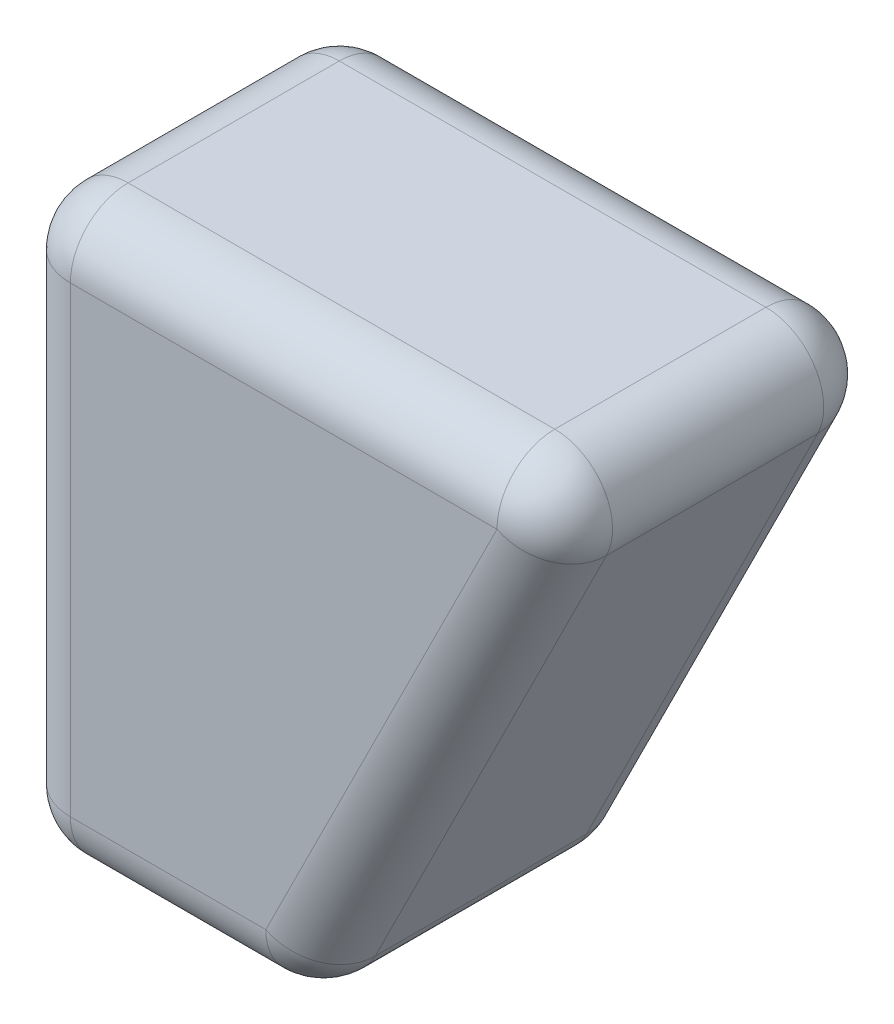
ISO-10303-21;
HEADER;
FILE_DESCRIPTION(('STEP AP214'),'2;1');
FILE_NAME('part.step','',(''),(''),'','','');
FILE_SCHEMA(('AUTOMOTIVE_DESIGN { 1 0 10303 214 1 1 1 1 }'));
ENDSEC;
DATA;
#1=APPLICATION_CONTEXT('core data for automotive mechanical design processes');
#2=APPLICATION_PROTOCOL_DEFINITION('international standard','automotive_design',2000,#1);
#3=PRODUCT_CONTEXT('',#1,'mechanical');
#4=PRODUCT('Part','Part','',(#3));
#5=PRODUCT_RELATED_PRODUCT_CATEGORY('part','',(#4));
#6=PRODUCT_DEFINITION_FORMATION('','',#4);
#7=PRODUCT_DEFINITION_CONTEXT('part definition',#1,'design');
#8=PRODUCT_DEFINITION('design','',#6,#7);
#9=PRODUCT_DEFINITION_SHAPE('','',#8);
#10=(LENGTH_UNIT() NAMED_UNIT(*) SI_UNIT(.MILLI.,.METRE.));
#11=(NAMED_UNIT(*) PLANE_ANGLE_UNIT() SI_UNIT($,.RADIAN.));
#12=(NAMED_UNIT(*) SI_UNIT($,.STERADIAN.) SOLID_ANGLE_UNIT());
#13=UNCERTAINTY_MEASURE_WITH_UNIT(LENGTH_MEASURE(1.E-05),#10,'distance_accuracy_value','');
#14=(GEOMETRIC_REPRESENTATION_CONTEXT(3) GLOBAL_UNCERTAINTY_ASSIGNED_CONTEXT((#13)) GLOBAL_UNIT_ASSIGNED_CONTEXT((#10,
#11,#12)) REPRESENTATION_CONTEXT('',''));
#15=CARTESIAN_POINT('',(0.,0.,0.));
#16=DIRECTION('',(0.,0.,1.));
#17=DIRECTION('',(1.,0.,0.));
#18=AXIS2_PLACEMENT_3D('',#15,#16,#17);
#19=CARTESIAN_POINT('',(99.9999999998445,130.770794392528,-56.5363275961389));
#20=DIRECTION('',(0.,0.,-1.));
#21=DIRECTION('',(1.,0.,0.));
#22=AXIS2_PLACEMENT_3D('',#19,#20,#21);
#23=PLANE('',#22);
#24=DIRECTION('',(-1.,0.,0.));
#25=VECTOR('',#24,1.);
#26=CARTESIAN_POINT('',(99.9999999998445,20.7707943925285,-56.5363275961389));
#27=LINE('',#26,#25);
#28=CARTESIAN_POINT('',(10.0000000000007,20.7707943925285,-56.5363275961389));
#29=VERTEX_POINT('',#28);
#30=CARTESIAN_POINT('',(83.8196601125024,20.7707943925285,-56.5363275961389));
#31=VERTEX_POINT('',#30);
#32=EDGE_CURVE('E169',#29,#31,#27,.F.);
#33=ORIENTED_EDGE('',*,*,#32,.T.);
#34=DIRECTION('',(0.447213595499924,0.894427190999933,0.));
#35=VECTOR('',#34,1.);
#36=CARTESIAN_POINT('',(131.055728089968,115.242930347468,-56.5363275961389));
#37=LINE('',#36,#35);
#38=CARTESIAN_POINT('',(43.8196601125017,-59.2292056074806,-56.5363275961389));
#39=VERTEX_POINT('',#38);
#40=EDGE_CURVE('E171',#31,#39,#37,.F.);
#41=ORIENTED_EDGE('',*,*,#40,.T.);
#42=DIRECTION('',(1.,0.,0.));
#43=VECTOR('',#42,1.);
#44=CARTESIAN_POINT('',(99.9999999998445,-59.2292056074805,-56.5363275961389));
#45=LINE('',#44,#43);
#46=CARTESIAN_POINT('',(10.0000000000009,-59.2292056074806,-56.5363275961389));
#47=VERTEX_POINT('',#46);
#48=EDGE_CURVE('E165',#39,#47,#45,.F.);
#49=ORIENTED_EDGE('',*,*,#48,.T.);
#50=DIRECTION('',(0.,-1.,0.));
#51=VECTOR('',#50,1.);
#52=CARTESIAN_POINT('',(10.0000000000005,130.770794392528,-56.5363275961389));
#53=LINE('',#52,#51);
#54=EDGE_CURVE('E167',#47,#29,#53,.F.);
#55=ORIENTED_EDGE('',*,*,#54,.T.);
#56=EDGE_LOOP('',(#33,#41,#49,#55));
#57=FACE_BOUND('',#56,.T.);
#58=ADVANCED_FACE('F33',(#57),#23,.T.);
#59=CARTESIAN_POINT('',(0.,0.,0.));
#60=DIRECTION('',(0.,0.,1.));
#61=DIRECTION('',(1.,0.,0.));
#62=AXIS2_PLACEMENT_3D('',#59,#60,#61);
#63=PLANE('',#62);
#64=DIRECTION('',(1.,0.,0.));
#65=VECTOR('',#64,1.);
#66=CARTESIAN_POINT('',(0.,-59.2292056074806,0.));
#67=LINE('',#66,#65);
#68=CARTESIAN_POINT('',(10.0000000000009,-59.2292056074806,0.));
#69=VERTEX_POINT('',#68);
#70=CARTESIAN_POINT('',(43.8196601125017,-59.2292056074806,0.));
#71=VERTEX_POINT('',#70);
#72=EDGE_CURVE('E183',#69,#71,#67,.T.);
#73=ORIENTED_EDGE('',*,*,#72,.T.);
#74=DIRECTION('',(0.447213595499924,0.894427190999933,0.));
#75=VECTOR('',#74,1.);
#76=CARTESIAN_POINT('',(58.7474103329936,-29.373705166494,0.));
#77=LINE('',#76,#75);
#78=CARTESIAN_POINT('',(83.8196601125024,20.7707943925285,0.));
#79=VERTEX_POINT('',#78);
#80=EDGE_CURVE('E139',#71,#79,#77,.T.);
#81=ORIENTED_EDGE('',*,*,#80,.T.);
#82=DIRECTION('',(-1.,0.,0.));
#83=VECTOR('',#82,1.);
#84=CARTESIAN_POINT('',(0.,20.7707943925285,0.));
#85=LINE('',#84,#83);
#86=CARTESIAN_POINT('',(10.0000000000007,20.7707943925285,0.));
#87=VERTEX_POINT('',#86);
#88=EDGE_CURVE('E187',#79,#87,#85,.T.);
#89=ORIENTED_EDGE('',*,*,#88,.T.);
#90=DIRECTION('',(0.,-1.,0.));
#91=VECTOR('',#90,1.);
#92=CARTESIAN_POINT('',(10.0000000000007,0.,0.));
#93=LINE('',#92,#91);
#94=EDGE_CURVE('E185',#87,#69,#93,.T.);
#95=ORIENTED_EDGE('',*,*,#94,.T.);
#96=EDGE_LOOP('',(#73,#81,#89,#95));
#97=FACE_BOUND('',#96,.T.);
#98=ADVANCED_FACE('F297',(#97),#63,.T.);
#99=CARTESIAN_POINT('',(100.000000000001,30.7707943925285,-197.957683833455));
#100=DIRECTION('',(0.,1.,0.));
#101=DIRECTION('',(0.,0.,1.));
#102=AXIS2_PLACEMENT_3D('',#99,#100,#101);
#103=PLANE('',#102);
#104=DIRECTION('',(-1.,0.,0.));
#105=VECTOR('',#104,1.);
#106=CARTESIAN_POINT('',(100.000000000001,30.7707943925285,-10.));
#107=LINE('',#106,#105);
#108=CARTESIAN_POINT('',(10.0000000000007,30.7707943925285,-10.));
#109=VERTEX_POINT('',#108);
#110=CARTESIAN_POINT('',(83.8196601125024,30.7707943925285,-10.));
#111=VERTEX_POINT('',#110);
#112=EDGE_CURVE('E176',#109,#111,#107,.F.);
#113=ORIENTED_EDGE('',*,*,#112,.T.);
#114=DIRECTION('',(0.,0.,1.));
#115=VECTOR('',#114,1.);
#116=CARTESIAN_POINT('',(83.8196601125024,30.7707943925285,-197.957683833455));
#117=LINE('',#116,#115);
#118=CARTESIAN_POINT('',(83.8196601125024,30.7707943925285,-46.5363275961389));
#119=VERTEX_POINT('',#118);
#120=EDGE_CURVE('E180',#111,#119,#117,.F.);
#121=ORIENTED_EDGE('',*,*,#120,.T.);
#122=DIRECTION('',(-1.,0.,0.));
#123=VECTOR('',#122,1.);
#124=CARTESIAN_POINT('',(100.000000000001,30.7707943925285,-46.5363275961389));
#125=LINE('',#124,#123);
#126=CARTESIAN_POINT('',(10.0000000000007,30.7707943925285,-46.5363275961389));
#127=VERTEX_POINT('',#126);
#128=EDGE_CURVE('E178',#119,#127,#125,.T.);
#129=ORIENTED_EDGE('',*,*,#128,.T.);
#130=DIRECTION('',(0.,0.,1.));
#131=VECTOR('',#130,1.);
#132=CARTESIAN_POINT('',(10.0000000000007,30.7707943925285,-197.957683833455));
#133=LINE('',#132,#131);
#134=EDGE_CURVE('E174',#127,#109,#133,.T.);
#135=ORIENTED_EDGE('',*,*,#134,.T.);
#136=EDGE_LOOP('',(#113,#121,#129,#135));
#137=FACE_BOUND('',#136,.T.);
#138=ADVANCED_FACE('F266',(#137),#103,.T.);
#139=CARTESIAN_POINT('',(6.93889390390723E-13,30.7707943925285,-197.957683833455));
#140=DIRECTION('',(-1.,0.,0.));
#141=DIRECTION('',(0.,-1.,0.));
#142=AXIS2_PLACEMENT_3D('',#139,#140,#141);
#143=PLANE('',#142);
#144=DIRECTION('',(0.,0.,1.));
#145=VECTOR('',#144,1.);
#146=CARTESIAN_POINT('',(8.56259507742154E-13,-59.2292056074806,-197.957683833455));
#147=LINE('',#146,#145);
#148=CARTESIAN_POINT('',(8.56259507742154E-13,-59.2292056074806,-46.5363275961389));
#149=VERTEX_POINT('',#148);
#150=CARTESIAN_POINT('',(8.56259507742154E-13,-59.2292056074806,-10.));
#151=VERTEX_POINT('',#150);
#152=EDGE_CURVE('E190',#149,#151,#147,.T.);
#153=ORIENTED_EDGE('',*,*,#152,.T.);
#154=DIRECTION('',(0.,-1.,0.));
#155=VECTOR('',#154,1.);
#156=CARTESIAN_POINT('',(6.93889390390723E-13,30.7707943925285,-10.));
#157=LINE('',#156,#155);
#158=CARTESIAN_POINT('',(7.1193051454088E-13,20.7707943925285,-10.));
#159=VERTEX_POINT('',#158);
#160=EDGE_CURVE('E196',#151,#159,#157,.F.);
#161=ORIENTED_EDGE('',*,*,#160,.T.);
#162=DIRECTION('',(0.,0.,1.));
#163=VECTOR('',#162,1.);
#164=CARTESIAN_POINT('',(7.1193051454088E-13,20.7707943925285,-197.957683833455));
#165=LINE('',#164,#163);
#166=CARTESIAN_POINT('',(7.1193051454088E-13,20.7707943925285,-46.5363275961389));
#167=VERTEX_POINT('',#166);
#168=EDGE_CURVE('E194',#159,#167,#165,.F.);
#169=ORIENTED_EDGE('',*,*,#168,.T.);
#170=DIRECTION('',(0.,-1.,0.));
#171=VECTOR('',#170,1.);
#172=CARTESIAN_POINT('',(6.93889390390723E-13,30.7707943925285,-46.5363275961389));
#173=LINE('',#172,#171);
#174=EDGE_CURVE('E192',#167,#149,#173,.T.);
#175=ORIENTED_EDGE('',*,*,#174,.T.);
#176=EDGE_LOOP('',(#153,#161,#169,#175));
#177=FACE_BOUND('',#176,.T.);
#178=ADVANCED_FACE('F275',(#177),#143,.T.);
#179=CARTESIAN_POINT('',(8.74300631892311E-13,-69.2292056074806,-197.957683833455));
#180=DIRECTION('',(0.,-1.,0.));
#181=DIRECTION('',(0.,0.,-1.));
#182=AXIS2_PLACEMENT_3D('',#179,#180,#181);
#183=PLANE('',#182);
#184=DIRECTION('',(0.,0.,1.));
#185=VECTOR('',#184,1.);
#186=CARTESIAN_POINT('',(43.8196601125017,-69.2292056074806,-197.957683833455));
#187=LINE('',#186,#185);
#188=CARTESIAN_POINT('',(43.8196601125017,-69.2292056074806,-46.5363275961389));
#189=VERTEX_POINT('',#188);
#190=CARTESIAN_POINT('',(43.8196601125017,-69.2292056074806,-10.));
#191=VERTEX_POINT('',#190);
#192=EDGE_CURVE('E199',#189,#191,#187,.T.);
#193=ORIENTED_EDGE('',*,*,#192,.T.);
#194=DIRECTION('',(1.,0.,0.));
#195=VECTOR('',#194,1.);
#196=CARTESIAN_POINT('',(8.74300631892311E-13,-69.2292056074806,-10.));
#197=LINE('',#196,#195);
#198=CARTESIAN_POINT('',(10.0000000000009,-69.2292056074806,-10.));
#199=VERTEX_POINT('',#198);
#200=EDGE_CURVE('E11',#191,#199,#197,.F.);
#201=ORIENTED_EDGE('',*,*,#200,.T.);
#202=DIRECTION('',(0.,0.,1.));
#203=VECTOR('',#202,1.);
#204=CARTESIAN_POINT('',(10.0000000000009,-69.2292056074806,-197.957683833455));
#205=LINE('',#204,#203);
#206=CARTESIAN_POINT('',(10.0000000000009,-69.2292056074806,-46.5363275961389));
#207=VERTEX_POINT('',#206);
#208=EDGE_CURVE('E42',#199,#207,#205,.F.);
#209=ORIENTED_EDGE('',*,*,#208,.T.);
#210=DIRECTION('',(1.,0.,0.));
#211=VECTOR('',#210,1.);
#212=CARTESIAN_POINT('',(8.74481608642121E-13,-69.2292056074806,-46.5363275961389));
#213=LINE('',#212,#211);
#214=EDGE_CURVE('E201',#207,#189,#213,.T.);
#215=ORIENTED_EDGE('',*,*,#214,.T.);
#216=EDGE_LOOP('',(#193,#201,#209,#215));
#217=FACE_BOUND('',#216,.T.);
#218=ADVANCED_FACE('F310',(#217),#183,.T.);
#219=CARTESIAN_POINT('',(50.0000000000009,-69.2292056074806,-197.957683833455));
#220=DIRECTION('',(0.894427190999933,-0.447213595499924,0.));
#221=DIRECTION('',(0.447213595499924,0.894427190999933,0.));
#222=AXIS2_PLACEMENT_3D('',#219,#220,#221);
#223=PLANE('',#222);
#224=DIRECTION('',(0.,0.,1.));
#225=VECTOR('',#224,1.);
#226=CARTESIAN_POINT('',(52.763932022501,-63.7013415624798,-197.957683833455));
#227=LINE('',#226,#225);
#228=CARTESIAN_POINT('',(52.763932022501,-63.7013415624798,-10.));
#229=VERTEX_POINT('',#228);
#230=CARTESIAN_POINT('',(52.763932022501,-63.7013415624798,-46.5363275961389));
#231=VERTEX_POINT('',#230);
#232=EDGE_CURVE('E125',#229,#231,#227,.F.);
#233=ORIENTED_EDGE('',*,*,#232,.T.);
#234=DIRECTION('',(0.447213595499924,0.894427190999933,0.));
#235=VECTOR('',#234,1.);
#236=CARTESIAN_POINT('',(50.0000000000009,-69.2292056074805,-46.5363275961389));
#237=LINE('',#236,#235);
#238=CARTESIAN_POINT('',(92.7639320225017,16.2986584375292,-46.5363275961389));
#239=VERTEX_POINT('',#238);
#240=EDGE_CURVE('E163',#231,#239,#237,.T.);
#241=ORIENTED_EDGE('',*,*,#240,.T.);
#242=DIRECTION('',(0.,0.,1.));
#243=VECTOR('',#242,1.);
#244=CARTESIAN_POINT('',(92.7639320225017,16.2986584375292,-197.957683833455));
#245=LINE('',#244,#243);
#246=CARTESIAN_POINT('',(92.7639320225017,16.2986584375292,-10.));
#247=VERTEX_POINT('',#246);
#248=EDGE_CURVE('E128',#239,#247,#245,.T.);
#249=ORIENTED_EDGE('',*,*,#248,.T.);
#250=DIRECTION('',(0.447213595499924,0.894427190999933,0.));
#251=VECTOR('',#250,1.);
#252=CARTESIAN_POINT('',(50.0000000000009,-69.2292056074806,-10.));
#253=LINE('',#252,#251);
#254=EDGE_CURVE('E120',#247,#229,#253,.F.);
#255=ORIENTED_EDGE('',*,*,#254,.T.);
#256=EDGE_LOOP('',(#233,#241,#249,#255));
#257=FACE_BOUND('',#256,.T.);
#258=ADVANCED_FACE('F122',(#257),#223,.T.);
#259=CARTESIAN_POINT('',(10.0000000000007,0.,-10.));
#260=DIRECTION('',(0.,-1.,0.));
#261=DIRECTION('',(1.,0.,0.));
#262=AXIS2_PLACEMENT_3D('',#259,#260,#261);
#263=CYLINDRICAL_SURFACE('',#262,10.);
#264=CARTESIAN_POINT('',(10.0000000000009,-59.2292056074806,-10.));
#265=DIRECTION('',(0.,-1.,0.));
#266=DIRECTION('',(1.,0.,0.));
#267=AXIS2_PLACEMENT_3D('',#264,#265,#266);
#268=CIRCLE('',#267,10.);
#269=EDGE_CURVE('E37',#69,#151,#268,.T.);
#270=ORIENTED_EDGE('',*,*,#269,.F.);
#271=ORIENTED_EDGE('',*,*,#94,.F.);
#272=CARTESIAN_POINT('',(10.0000000000007,20.7707943925285,-10.));
#273=DIRECTION('',(0.,1.,0.));
#274=DIRECTION('',(-1.,0.,0.));
#275=AXIS2_PLACEMENT_3D('',#272,#273,#274);
#276=CIRCLE('',#275,10.);
#277=EDGE_CURVE('E160',#159,#87,#276,.T.);
#278=ORIENTED_EDGE('',*,*,#277,.F.);
#279=ORIENTED_EDGE('',*,*,#160,.F.);
#280=EDGE_LOOP('',(#270,#271,#278,#279));
#281=FACE_BOUND('',#280,.T.);
#282=ADVANCED_FACE('F35',(#281),#263,.T.);
#283=CARTESIAN_POINT('',(10.0000000000009,-59.2292056074806,-10.));
#284=DIRECTION('',(0.,0.,1.));
#285=DIRECTION('',(1.,0.,0.));
#286=AXIS2_PLACEMENT_3D('',#283,#284,#285);
#287=SPHERICAL_SURFACE('',#286,10.);
#288=CARTESIAN_POINT('',(10.0000000000009,-59.2292056074806,-10.));
#289=DIRECTION('',(-1.,0.,0.));
#290=DIRECTION('',(0.,0.,1.));
#291=AXIS2_PLACEMENT_3D('',#288,#289,#290);
#292=CIRCLE('',#291,10.);
#293=EDGE_CURVE('E246',#69,#199,#292,.F.);
#294=ORIENTED_EDGE('',*,*,#293,.F.);
#295=ORIENTED_EDGE('',*,*,#269,.T.);
#296=CARTESIAN_POINT('',(10.0000000000009,-59.2292056074806,-10.));
#297=DIRECTION('',(0.,0.,1.));
#298=DIRECTION('',(1.,0.,0.));
#299=AXIS2_PLACEMENT_3D('',#296,#297,#298);
#300=CIRCLE('',#299,10.);
#301=EDGE_CURVE('E249',#199,#151,#300,.F.);
#302=ORIENTED_EDGE('',*,*,#301,.F.);
#303=EDGE_LOOP('',(#294,#295,#302));
#304=FACE_BOUND('',#303,.T.);
#305=ADVANCED_FACE('F291',(#304),#287,.T.);
#306=CARTESIAN_POINT('',(10.0000000000007,20.7707943925285,-10.));
#307=DIRECTION('',(0.,0.,1.));
#308=DIRECTION('',(1.,0.,0.));
#309=AXIS2_PLACEMENT_3D('',#306,#307,#308);
#310=SPHERICAL_SURFACE('',#309,10.);
#311=CARTESIAN_POINT('',(10.0000000000007,20.7707943925285,-10.));
#312=DIRECTION('',(0.,0.,1.));
#313=DIRECTION('',(1.,0.,0.));
#314=AXIS2_PLACEMENT_3D('',#311,#312,#313);
#315=CIRCLE('',#314,10.);
#316=EDGE_CURVE('E240',#159,#109,#315,.F.);
#317=ORIENTED_EDGE('',*,*,#316,.F.);
#318=ORIENTED_EDGE('',*,*,#277,.T.);
#319=CARTESIAN_POINT('',(10.0000000000007,20.7707943925285,-10.));
#320=DIRECTION('',(-1.,0.,0.));
#321=DIRECTION('',(0.,-1.,0.));
#322=AXIS2_PLACEMENT_3D('',#319,#320,#321);
#323=CIRCLE('',#322,10.);
#324=EDGE_CURVE('E243',#109,#87,#323,.F.);
#325=ORIENTED_EDGE('',*,*,#324,.F.);
#326=EDGE_LOOP('',(#317,#318,#325));
#327=FACE_BOUND('',#326,.T.);
#328=ADVANCED_FACE('F255',(#327),#310,.T.);
#329=CARTESIAN_POINT('',(10.0000000000009,-59.2292056074806,-197.957683833455));
#330=DIRECTION('',(0.,0.,1.));
#331=DIRECTION('',(1.,0.,0.));
#332=AXIS2_PLACEMENT_3D('',#329,#330,#331);
#333=CYLINDRICAL_SURFACE('',#332,10.);
#334=ORIENTED_EDGE('',*,*,#301,.T.);
#335=ORIENTED_EDGE('',*,*,#152,.F.);
#336=CARTESIAN_POINT('',(10.0000000000009,-59.2292056074806,-46.5363275961389));
#337=DIRECTION('',(0.,0.,-1.));
#338=DIRECTION('',(-1.,0.,0.));
#339=AXIS2_PLACEMENT_3D('',#336,#337,#338);
#340=CIRCLE('',#339,10.);
#341=EDGE_CURVE('E234',#207,#149,#340,.T.);
#342=ORIENTED_EDGE('',*,*,#341,.F.);
#343=ORIENTED_EDGE('',*,*,#208,.F.);
#344=EDGE_LOOP('',(#334,#335,#342,#343));
#345=FACE_BOUND('',#344,.T.);
#346=ADVANCED_FACE('F287',(#345),#333,.T.);
#347=CARTESIAN_POINT('',(0.,-59.2292056074806,-10.));
#348=DIRECTION('',(1.,0.,0.));
#349=DIRECTION('',(0.,0.,-1.));
#350=AXIS2_PLACEMENT_3D('',#347,#348,#349);
#351=CYLINDRICAL_SURFACE('',#350,10.);
#352=ORIENTED_EDGE('',*,*,#293,.T.);
#353=ORIENTED_EDGE('',*,*,#200,.F.);
#354=CARTESIAN_POINT('',(43.8196601125017,-59.2292056074806,-10.));
#355=DIRECTION('',(1.,0.,0.));
#356=DIRECTION('',(0.,1.,0.));
#357=AXIS2_PLACEMENT_3D('',#354,#355,#356);
#358=CIRCLE('',#357,10.);
#359=EDGE_CURVE('E143',#71,#191,#358,.T.);
#360=ORIENTED_EDGE('',*,*,#359,.F.);
#361=ORIENTED_EDGE('',*,*,#72,.F.);
#362=EDGE_LOOP('',(#352,#353,#360,#361));
#363=FACE_BOUND('',#362,.T.);
#364=ADVANCED_FACE('F295',(#363),#351,.T.);
#365=CARTESIAN_POINT('',(58.7474103329935,-29.373705166494,-10.));
#366=DIRECTION('',(0.447213595499924,0.894427190999933,0.));
#367=DIRECTION('',(-0.894427190999933,0.447213595499924,0.));
#368=AXIS2_PLACEMENT_3D('',#365,#366,#367);
#369=CYLINDRICAL_SURFACE('',#368,10.);
#370=CARTESIAN_POINT('',(83.8196601125024,20.7707943925285,-10.));
#371=DIRECTION('',(0.447213595499924,0.894427190999933,0.));
#372=DIRECTION('',(-0.894427190999933,0.447213595499924,0.));
#373=AXIS2_PLACEMENT_3D('',#370,#371,#372);
#374=CIRCLE('',#373,10.);
#375=EDGE_CURVE('E144',#79,#247,#374,.T.);
#376=ORIENTED_EDGE('',*,*,#375,.F.);
#377=ORIENTED_EDGE('',*,*,#80,.F.);
#378=CARTESIAN_POINT('',(43.8196601125017,-59.2292056074806,-10.));
#379=DIRECTION('',(-0.447213595499924,-0.894427190999933,0.));
#380=DIRECTION('',(0.894427190999933,-0.447213595499924,0.));
#381=AXIS2_PLACEMENT_3D('',#378,#379,#380);
#382=CIRCLE('',#381,10.);
#383=EDGE_CURVE('E135',#229,#71,#382,.T.);
#384=ORIENTED_EDGE('',*,*,#383,.F.);
#385=ORIENTED_EDGE('',*,*,#254,.F.);
#386=EDGE_LOOP('',(#376,#377,#384,#385));
#387=FACE_BOUND('',#386,.T.);
#388=ADVANCED_FACE('F137',(#387),#369,.T.);
#389=CARTESIAN_POINT('',(0.,20.7707943925285,-10.));
#390=DIRECTION('',(-1.,0.,0.));
#391=DIRECTION('',(0.,0.,1.));
#392=AXIS2_PLACEMENT_3D('',#389,#390,#391);
#393=CYLINDRICAL_SURFACE('',#392,10.);
#394=ORIENTED_EDGE('',*,*,#324,.T.);
#395=ORIENTED_EDGE('',*,*,#88,.F.);
#396=CARTESIAN_POINT('',(83.8196601125024,20.7707943925285,-10.));
#397=DIRECTION('',(1.,0.,0.));
#398=DIRECTION('',(0.,0.,-1.));
#399=AXIS2_PLACEMENT_3D('',#396,#397,#398);
#400=CIRCLE('',#399,10.);
#401=EDGE_CURVE('E230',#111,#79,#400,.T.);
#402=ORIENTED_EDGE('',*,*,#401,.F.);
#403=ORIENTED_EDGE('',*,*,#112,.F.);
#404=EDGE_LOOP('',(#394,#395,#402,#403));
#405=FACE_BOUND('',#404,.T.);
#406=ADVANCED_FACE('F262',(#405),#393,.T.);
#407=CARTESIAN_POINT('',(10.0000000000007,20.7707943925285,-197.957683833455));
#408=DIRECTION('',(0.,0.,1.));
#409=DIRECTION('',(1.,0.,0.));
#410=AXIS2_PLACEMENT_3D('',#407,#408,#409);
#411=CYLINDRICAL_SURFACE('',#410,10.);
#412=ORIENTED_EDGE('',*,*,#316,.T.);
#413=ORIENTED_EDGE('',*,*,#134,.F.);
#414=CARTESIAN_POINT('',(10.0000000000007,20.7707943925285,-46.5363275961389));
#415=DIRECTION('',(0.,0.,-1.));
#416=DIRECTION('',(-1.,0.,0.));
#417=AXIS2_PLACEMENT_3D('',#414,#415,#416);
#418=CIRCLE('',#417,10.);
#419=EDGE_CURVE('E227',#167,#127,#418,.T.);
#420=ORIENTED_EDGE('',*,*,#419,.F.);
#421=ORIENTED_EDGE('',*,*,#168,.F.);
#422=EDGE_LOOP('',(#412,#413,#420,#421));
#423=FACE_BOUND('',#422,.T.);
#424=ADVANCED_FACE('F272',(#423),#411,.T.);
#425=CARTESIAN_POINT('',(10.0000000000007,30.7707943925285,-46.5363275961389));
#426=DIRECTION('',(0.,-1.,0.));
#427=DIRECTION('',(1.,0.,0.));
#428=AXIS2_PLACEMENT_3D('',#425,#426,#427);
#429=CYLINDRICAL_SURFACE('',#428,10.);
#430=CARTESIAN_POINT('',(10.0000000000009,-59.2292056074806,-46.5363275961389));
#431=DIRECTION('',(0.,-1.,0.));
#432=DIRECTION('',(1.,0.,0.));
#433=AXIS2_PLACEMENT_3D('',#430,#431,#432);
#434=CIRCLE('',#433,10.);
#435=EDGE_CURVE('E237',#149,#47,#434,.T.);
#436=ORIENTED_EDGE('',*,*,#435,.F.);
#437=ORIENTED_EDGE('',*,*,#174,.F.);
#438=CARTESIAN_POINT('',(10.0000000000007,20.7707943925285,-46.5363275961389));
#439=DIRECTION('',(0.,1.,0.));
#440=DIRECTION('',(-1.,0.,0.));
#441=AXIS2_PLACEMENT_3D('',#438,#439,#440);
#442=CIRCLE('',#441,10.);
#443=EDGE_CURVE('E224',#29,#167,#442,.T.);
#444=ORIENTED_EDGE('',*,*,#443,.F.);
#445=ORIENTED_EDGE('',*,*,#54,.F.);
#446=EDGE_LOOP('',(#436,#437,#444,#445));
#447=FACE_BOUND('',#446,.T.);
#448=ADVANCED_FACE('F280',(#447),#429,.T.);
#449=CARTESIAN_POINT('',(10.0000000000009,-59.2292056074806,-46.5363275961389));
#450=DIRECTION('',(0.,0.,1.));
#451=DIRECTION('',(1.,0.,0.));
#452=AXIS2_PLACEMENT_3D('',#449,#450,#451);
#453=SPHERICAL_SURFACE('',#452,10.);
#454=ORIENTED_EDGE('',*,*,#341,.T.);
#455=ORIENTED_EDGE('',*,*,#435,.T.);
#456=CARTESIAN_POINT('',(10.0000000000009,-59.2292056074806,-46.5363275961389));
#457=DIRECTION('',(-1.,0.,0.));
#458=DIRECTION('',(0.,0.,1.));
#459=AXIS2_PLACEMENT_3D('',#456,#457,#458);
#460=CIRCLE('',#459,10.);
#461=EDGE_CURVE('E151',#207,#47,#460,.F.);
#462=ORIENTED_EDGE('',*,*,#461,.F.);
#463=EDGE_LOOP('',(#454,#455,#462));
#464=FACE_BOUND('',#463,.T.);
#465=ADVANCED_FACE('F285',(#464),#453,.T.);
#466=CARTESIAN_POINT('',(43.8196601125017,-59.2292056074806,-10.));
#467=DIRECTION('',(0.,0.,1.));
#468=DIRECTION('',(1.,0.,0.));
#469=AXIS2_PLACEMENT_3D('',#466,#467,#468);
#470=SPHERICAL_SURFACE('',#469,10.);
#471=ORIENTED_EDGE('',*,*,#383,.T.);
#472=ORIENTED_EDGE('',*,*,#359,.T.);
#473=CARTESIAN_POINT('',(43.8196601125017,-59.2292056074806,-10.));
#474=DIRECTION('',(0.,0.,1.));
#475=DIRECTION('',(1.,0.,0.));
#476=AXIS2_PLACEMENT_3D('',#473,#474,#475);
#477=CIRCLE('',#476,10.);
#478=EDGE_CURVE('E147',#229,#191,#477,.F.);
#479=ORIENTED_EDGE('',*,*,#478,.F.);
#480=EDGE_LOOP('',(#471,#472,#479));
#481=FACE_BOUND('',#480,.T.);
#482=ADVANCED_FACE('F148',(#481),#470,.T.);
#483=CARTESIAN_POINT('',(83.8196601125024,20.7707943925285,-10.));
#484=DIRECTION('',(0.,0.,1.));
#485=DIRECTION('',(1.,0.,0.));
#486=AXIS2_PLACEMENT_3D('',#483,#484,#485);
#487=SPHERICAL_SURFACE('',#486,10.);
#488=ORIENTED_EDGE('',*,*,#401,.T.);
#489=ORIENTED_EDGE('',*,*,#375,.T.);
#490=CARTESIAN_POINT('',(83.8196601125024,20.7707943925285,-10.));
#491=DIRECTION('',(0.,0.,1.));
#492=DIRECTION('',(1.,0.,0.));
#493=AXIS2_PLACEMENT_3D('',#490,#491,#492);
#494=CIRCLE('',#493,10.);
#495=EDGE_CURVE('E152',#111,#247,#494,.F.);
#496=ORIENTED_EDGE('',*,*,#495,.F.);
#497=EDGE_LOOP('',(#488,#489,#496));
#498=FACE_BOUND('',#497,.T.);
#499=ADVANCED_FACE('F344',(#498),#487,.T.);
#500=CARTESIAN_POINT('',(10.0000000000007,20.7707943925285,-46.5363275961389));
#501=DIRECTION('',(0.,0.,1.));
#502=DIRECTION('',(1.,0.,0.));
#503=AXIS2_PLACEMENT_3D('',#500,#501,#502);
#504=SPHERICAL_SURFACE('',#503,10.);
#505=ORIENTED_EDGE('',*,*,#443,.T.);
#506=ORIENTED_EDGE('',*,*,#419,.T.);
#507=CARTESIAN_POINT('',(10.0000000000007,20.7707943925285,-46.5363275961389));
#508=DIRECTION('',(-1.,0.,0.));
#509=DIRECTION('',(0.,0.,1.));
#510=AXIS2_PLACEMENT_3D('',#507,#508,#509);
#511=CIRCLE('',#510,10.);
#512=EDGE_CURVE('E217',#29,#127,#511,.F.);
#513=ORIENTED_EDGE('',*,*,#512,.F.);
#514=EDGE_LOOP('',(#505,#506,#513));
#515=FACE_BOUND('',#514,.T.);
#516=ADVANCED_FACE('F340',(#515),#504,.T.);
#517=CARTESIAN_POINT('',(8.74481608642121E-13,-59.2292056074806,-46.5363275961389));
#518=DIRECTION('',(1.,0.,0.));
#519=DIRECTION('',(0.,0.,-1.));
#520=AXIS2_PLACEMENT_3D('',#517,#518,#519);
#521=CYLINDRICAL_SURFACE('',#520,10.);
#522=ORIENTED_EDGE('',*,*,#461,.T.);
#523=ORIENTED_EDGE('',*,*,#48,.F.);
#524=CARTESIAN_POINT('',(43.8196601125017,-59.2292056074806,-46.5363275961389));
#525=DIRECTION('',(1.,0.,0.));
#526=DIRECTION('',(0.,0.,-1.));
#527=AXIS2_PLACEMENT_3D('',#524,#525,#526);
#528=CIRCLE('',#527,10.);
#529=EDGE_CURVE('E214',#189,#39,#528,.T.);
#530=ORIENTED_EDGE('',*,*,#529,.F.);
#531=ORIENTED_EDGE('',*,*,#214,.F.);
#532=EDGE_LOOP('',(#522,#523,#530,#531));
#533=FACE_BOUND('',#532,.T.);
#534=ADVANCED_FACE('F337',(#533),#521,.T.);
#535=CARTESIAN_POINT('',(43.8196601125017,-59.2292056074806,-197.957683833455));
#536=DIRECTION('',(0.,0.,1.));
#537=DIRECTION('',(1.,0.,0.));
#538=AXIS2_PLACEMENT_3D('',#535,#536,#537);
#539=CYLINDRICAL_SURFACE('',#538,10.);
#540=ORIENTED_EDGE('',*,*,#478,.T.);
#541=ORIENTED_EDGE('',*,*,#192,.F.);
#542=CARTESIAN_POINT('',(43.8196601125017,-59.2292056074806,-46.5363275961389));
#543=DIRECTION('',(0.,0.,-1.));
#544=DIRECTION('',(-1.,0.,0.));
#545=AXIS2_PLACEMENT_3D('',#542,#543,#544);
#546=CIRCLE('',#545,10.);
#547=EDGE_CURVE('E156',#231,#189,#546,.T.);
#548=ORIENTED_EDGE('',*,*,#547,.F.);
#549=ORIENTED_EDGE('',*,*,#232,.F.);
#550=EDGE_LOOP('',(#540,#541,#548,#549));
#551=FACE_BOUND('',#550,.T.);
#552=ADVANCED_FACE('F154',(#551),#539,.T.);
#553=CARTESIAN_POINT('',(83.8196601125024,20.7707943925285,-197.957683833455));
#554=DIRECTION('',(0.,0.,1.));
#555=DIRECTION('',(1.,0.,0.));
#556=AXIS2_PLACEMENT_3D('',#553,#554,#555);
#557=CYLINDRICAL_SURFACE('',#556,10.);
#558=ORIENTED_EDGE('',*,*,#495,.T.);
#559=ORIENTED_EDGE('',*,*,#248,.F.);
#560=CARTESIAN_POINT('',(83.8196601125024,20.7707943925285,-46.5363275961389));
#561=DIRECTION('',(0.,0.,-1.));
#562=DIRECTION('',(-1.,0.,0.));
#563=AXIS2_PLACEMENT_3D('',#560,#561,#562);
#564=CIRCLE('',#563,10.);
#565=EDGE_CURVE('E210',#119,#239,#564,.T.);
#566=ORIENTED_EDGE('',*,*,#565,.F.);
#567=ORIENTED_EDGE('',*,*,#120,.F.);
#568=EDGE_LOOP('',(#558,#559,#566,#567));
#569=FACE_BOUND('',#568,.T.);
#570=ADVANCED_FACE('F330',(#569),#557,.T.);
#571=CARTESIAN_POINT('',(100.000000000001,20.7707943925285,-46.5363275961389));
#572=DIRECTION('',(-1.,0.,0.));
#573=DIRECTION('',(0.,0.,1.));
#574=AXIS2_PLACEMENT_3D('',#571,#572,#573);
#575=CYLINDRICAL_SURFACE('',#574,10.);
#576=ORIENTED_EDGE('',*,*,#512,.T.);
#577=ORIENTED_EDGE('',*,*,#128,.F.);
#578=CARTESIAN_POINT('',(83.8196601125024,20.7707943925285,-46.5363275961389));
#579=DIRECTION('',(1.,0.,0.));
#580=DIRECTION('',(0.,0.,-1.));
#581=AXIS2_PLACEMENT_3D('',#578,#579,#580);
#582=CIRCLE('',#581,10.);
#583=EDGE_CURVE('E208',#31,#119,#582,.T.);
#584=ORIENTED_EDGE('',*,*,#583,.F.);
#585=ORIENTED_EDGE('',*,*,#32,.F.);
#586=EDGE_LOOP('',(#576,#577,#584,#585));
#587=FACE_BOUND('',#586,.T.);
#588=ADVANCED_FACE('F326',(#587),#575,.T.);
#589=CARTESIAN_POINT('',(43.8196601125017,-59.2292056074806,-46.5363275961389));
#590=DIRECTION('',(0.,0.,1.));
#591=DIRECTION('',(1.,0.,0.));
#592=AXIS2_PLACEMENT_3D('',#589,#590,#591);
#593=SPHERICAL_SURFACE('',#592,10.);
#594=ORIENTED_EDGE('',*,*,#547,.T.);
#595=ORIENTED_EDGE('',*,*,#529,.T.);
#596=CARTESIAN_POINT('',(43.8196601125017,-59.2292056074806,-46.5363275961389));
#597=DIRECTION('',(-0.447213595499924,-0.894427190999933,0.));
#598=DIRECTION('',(0.894427190999933,-0.447213595499924,0.));
#599=AXIS2_PLACEMENT_3D('',#596,#597,#598);
#600=CIRCLE('',#599,10.);
#601=EDGE_CURVE('E206',#231,#39,#600,.F.);
#602=ORIENTED_EDGE('',*,*,#601,.F.);
#603=EDGE_LOOP('',(#594,#595,#602));
#604=FACE_BOUND('',#603,.T.);
#605=ADVANCED_FACE('F322',(#604),#593,.T.);
#606=CARTESIAN_POINT('',(83.8196601125024,20.7707943925285,-46.5363275961389));
#607=DIRECTION('',(0.,0.,1.));
#608=DIRECTION('',(1.,0.,0.));
#609=AXIS2_PLACEMENT_3D('',#606,#607,#608);
#610=SPHERICAL_SURFACE('',#609,10.);
#611=ORIENTED_EDGE('',*,*,#583,.T.);
#612=ORIENTED_EDGE('',*,*,#565,.T.);
#613=CARTESIAN_POINT('',(83.8196601125024,20.7707943925285,-46.5363275961389));
#614=DIRECTION('',(0.447213595499924,0.894427190999933,0.));
#615=DIRECTION('',(-0.894427190999933,0.447213595499924,0.));
#616=AXIS2_PLACEMENT_3D('',#613,#614,#615);
#617=CIRCLE('',#616,10.);
#618=EDGE_CURVE('E204',#31,#239,#617,.F.);
#619=ORIENTED_EDGE('',*,*,#618,.F.);
#620=EDGE_LOOP('',(#611,#612,#619));
#621=FACE_BOUND('',#620,.T.);
#622=ADVANCED_FACE('F318',(#621),#610,.T.);
#623=CARTESIAN_POINT('',(41.0557280900016,-64.7570696524813,-46.5363275961389));
#624=DIRECTION('',(0.447213595499924,0.894427190999933,0.));
#625=DIRECTION('',(-0.894427190999933,0.447213595499924,0.));
#626=AXIS2_PLACEMENT_3D('',#623,#624,#625);
#627=CYLINDRICAL_SURFACE('',#626,10.);
#628=ORIENTED_EDGE('',*,*,#601,.T.);
#629=ORIENTED_EDGE('',*,*,#40,.F.);
#630=ORIENTED_EDGE('',*,*,#618,.T.);
#631=ORIENTED_EDGE('',*,*,#240,.F.);
#632=EDGE_LOOP('',(#628,#629,#630,#631));
#633=FACE_BOUND('',#632,.T.);
#634=ADVANCED_FACE('F315',(#633),#627,.T.);
#635=CLOSED_SHELL('',(#58,#98,#138,#178,#218,#258,#282,#305,#328,#346,#364,#388,#406,#424,#448,
#465,#482,#499,#516,#534,#552,#570,#588,#605,#622,#634));
#636=MANIFOLD_SOLID_BREP('B2',#635);
#637=ADVANCED_BREP_SHAPE_REPRESENTATION('',(#18,#636),#14);
#638=SHAPE_DEFINITION_REPRESENTATION(#9,#637);
ENDSEC;
END-ISO-10303-21;
